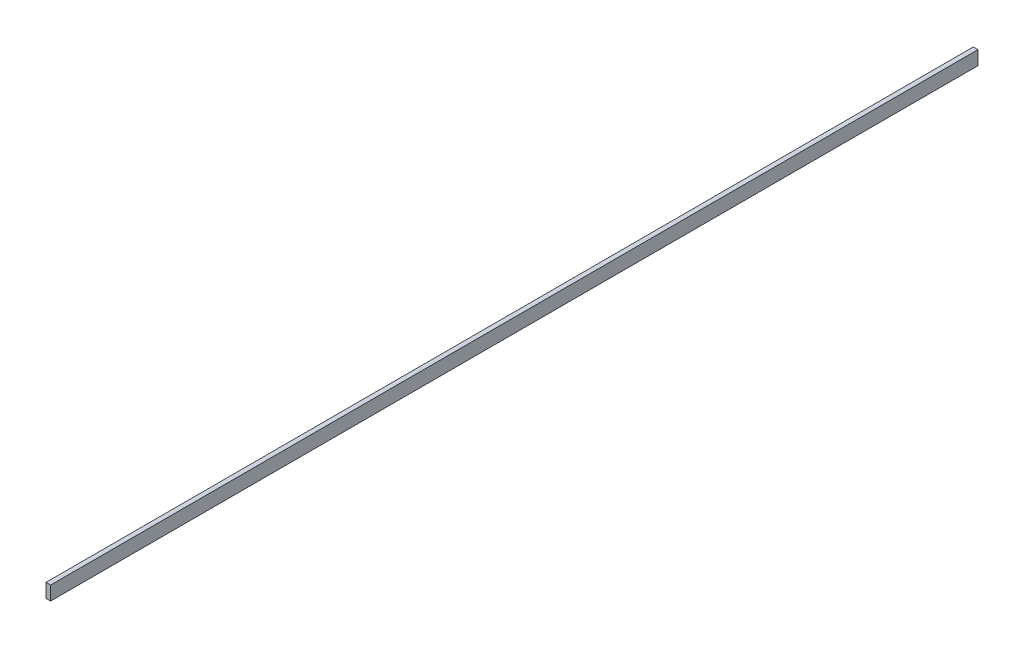
ISO-10303-21;
HEADER;
FILE_DESCRIPTION(('STEP AP214'),'2;1');
FILE_NAME('part.step','',(''),(''),'','','');
FILE_SCHEMA(('AUTOMOTIVE_DESIGN { 1 0 10303 214 1 1 1 1 }'));
ENDSEC;
DATA;
#1=APPLICATION_CONTEXT('core data for automotive mechanical design processes');
#2=APPLICATION_PROTOCOL_DEFINITION('international standard','automotive_design',2000,#1);
#3=PRODUCT_CONTEXT('',#1,'mechanical');
#4=PRODUCT('Part','Part','',(#3));
#5=PRODUCT_RELATED_PRODUCT_CATEGORY('part','',(#4));
#6=PRODUCT_DEFINITION_FORMATION('','',#4);
#7=PRODUCT_DEFINITION_CONTEXT('part definition',#1,'design');
#8=PRODUCT_DEFINITION('design','',#6,#7);
#9=PRODUCT_DEFINITION_SHAPE('','',#8);
#10=(LENGTH_UNIT() NAMED_UNIT(*) SI_UNIT(.MILLI.,.METRE.));
#11=(NAMED_UNIT(*) PLANE_ANGLE_UNIT() SI_UNIT($,.RADIAN.));
#12=(NAMED_UNIT(*) SI_UNIT($,.STERADIAN.) SOLID_ANGLE_UNIT());
#13=UNCERTAINTY_MEASURE_WITH_UNIT(LENGTH_MEASURE(1.E-05),#10,'distance_accuracy_value','');
#14=(GEOMETRIC_REPRESENTATION_CONTEXT(3) GLOBAL_UNCERTAINTY_ASSIGNED_CONTEXT((#13)) GLOBAL_UNIT_ASSIGNED_CONTEXT((#10,
#11,#12)) REPRESENTATION_CONTEXT('',''));
#15=CARTESIAN_POINT('',(0.,0.,0.));
#16=DIRECTION('',(0.,0.,1.));
#17=DIRECTION('',(1.,0.,0.));
#18=AXIS2_PLACEMENT_3D('',#15,#16,#17);
#19=CARTESIAN_POINT('',(0.,0.,0.));
#20=DIRECTION('',(0.,0.,1.));
#21=DIRECTION('',(1.,0.,0.));
#22=AXIS2_PLACEMENT_3D('',#19,#20,#21);
#23=PLANE('',#22);
#24=DIRECTION('',(0.,1.,0.));
#25=VECTOR('',#24,1.);
#26=CARTESIAN_POINT('',(1.,3.,0.));
#27=LINE('',#26,#25);
#28=CARTESIAN_POINT('',(1.,-3.,0.));
#29=VERTEX_POINT('',#28);
#30=CARTESIAN_POINT('',(1.,3.,0.));
#31=VERTEX_POINT('',#30);
#32=EDGE_CURVE('E72',#29,#31,#27,.T.);
#33=ORIENTED_EDGE('',*,*,#32,.T.);
#34=DIRECTION('',(-1.,0.,0.));
#35=VECTOR('',#34,1.);
#36=CARTESIAN_POINT('',(-1.,3.,0.));
#37=LINE('',#36,#35);
#38=CARTESIAN_POINT('',(-1.,3.,0.));
#39=VERTEX_POINT('',#38);
#40=EDGE_CURVE('E67',#31,#39,#37,.T.);
#41=ORIENTED_EDGE('',*,*,#40,.T.);
#42=DIRECTION('',(0.,-1.,0.));
#43=VECTOR('',#42,1.);
#44=CARTESIAN_POINT('',(-1.,3.,0.));
#45=LINE('',#44,#43);
#46=CARTESIAN_POINT('',(-1.,-3.,0.));
#47=VERTEX_POINT('',#46);
#48=EDGE_CURVE('E84',#39,#47,#45,.T.);
#49=ORIENTED_EDGE('',*,*,#48,.T.);
#50=DIRECTION('',(1.,0.,0.));
#51=VECTOR('',#50,1.);
#52=CARTESIAN_POINT('',(-1.,-3.,0.));
#53=LINE('',#52,#51);
#54=EDGE_CURVE('E77',#47,#29,#53,.T.);
#55=ORIENTED_EDGE('',*,*,#54,.T.);
#56=EDGE_LOOP('',(#33,#41,#49,#55));
#57=FACE_BOUND('',#56,.T.);
#58=ADVANCED_FACE('F32',(#57),#23,.T.);
#59=CARTESIAN_POINT('',(0.,0.,-400.));
#60=DIRECTION('',(0.,0.,1.));
#61=DIRECTION('',(1.,0.,0.));
#62=AXIS2_PLACEMENT_3D('',#59,#60,#61);
#63=PLANE('',#62);
#64=DIRECTION('',(0.,1.,0.));
#65=VECTOR('',#64,1.);
#66=CARTESIAN_POINT('',(1.,3.,-400.));
#67=LINE('',#66,#65);
#68=CARTESIAN_POINT('',(1.,-3.,-400.));
#69=VERTEX_POINT('',#68);
#70=CARTESIAN_POINT('',(1.,3.,-400.));
#71=VERTEX_POINT('',#70);
#72=EDGE_CURVE('E46',#69,#71,#67,.T.);
#73=ORIENTED_EDGE('',*,*,#72,.F.);
#74=DIRECTION('',(1.,0.,0.));
#75=VECTOR('',#74,1.);
#76=CARTESIAN_POINT('',(-1.,-3.,-400.));
#77=LINE('',#76,#75);
#78=CARTESIAN_POINT('',(-1.,-3.,-400.));
#79=VERTEX_POINT('',#78);
#80=EDGE_CURVE('E55',#79,#69,#77,.T.);
#81=ORIENTED_EDGE('',*,*,#80,.F.);
#82=DIRECTION('',(0.,-1.,0.));
#83=VECTOR('',#82,1.);
#84=CARTESIAN_POINT('',(-1.,3.,-400.));
#85=LINE('',#84,#83);
#86=CARTESIAN_POINT('',(-1.,3.,-400.));
#87=VERTEX_POINT('',#86);
#88=EDGE_CURVE('E92',#87,#79,#85,.T.);
#89=ORIENTED_EDGE('',*,*,#88,.F.);
#90=DIRECTION('',(-1.,0.,0.));
#91=VECTOR('',#90,1.);
#92=CARTESIAN_POINT('',(-1.,3.,-400.));
#93=LINE('',#92,#91);
#94=EDGE_CURVE('E11',#71,#87,#93,.T.);
#95=ORIENTED_EDGE('',*,*,#94,.F.);
#96=EDGE_LOOP('',(#73,#81,#89,#95));
#97=FACE_BOUND('',#96,.T.);
#98=ADVANCED_FACE('F114',(#97),#63,.F.);
#99=CARTESIAN_POINT('',(-1.,3.,0.));
#100=DIRECTION('',(1.,0.,0.));
#101=DIRECTION('',(0.,1.,0.));
#102=AXIS2_PLACEMENT_3D('',#99,#100,#101);
#103=PLANE('',#102);
#104=DIRECTION('',(0.,0.,-1.));
#105=VECTOR('',#104,1.);
#106=CARTESIAN_POINT('',(-1.,-3.,0.));
#107=LINE('',#106,#105);
#108=EDGE_CURVE('E87',#47,#79,#107,.T.);
#109=ORIENTED_EDGE('',*,*,#108,.F.);
#110=ORIENTED_EDGE('',*,*,#48,.F.);
#111=DIRECTION('',(0.,0.,-1.));
#112=VECTOR('',#111,1.);
#113=CARTESIAN_POINT('',(-1.,3.,0.));
#114=LINE('',#113,#112);
#115=EDGE_CURVE('E86',#39,#87,#114,.T.);
#116=ORIENTED_EDGE('',*,*,#115,.T.);
#117=ORIENTED_EDGE('',*,*,#88,.T.);
#118=EDGE_LOOP('',(#109,#110,#116,#117));
#119=FACE_BOUND('',#118,.T.);
#120=ADVANCED_FACE('F85',(#119),#103,.F.);
#121=CARTESIAN_POINT('',(-1.,-3.,0.));
#122=DIRECTION('',(0.,1.,0.));
#123=DIRECTION('',(0.,0.,1.));
#124=AXIS2_PLACEMENT_3D('',#121,#122,#123);
#125=PLANE('',#124);
#126=DIRECTION('',(0.,0.,-1.));
#127=VECTOR('',#126,1.);
#128=CARTESIAN_POINT('',(1.,-3.,0.));
#129=LINE('',#128,#127);
#130=EDGE_CURVE('E99',#29,#69,#129,.T.);
#131=ORIENTED_EDGE('',*,*,#130,.F.);
#132=ORIENTED_EDGE('',*,*,#54,.F.);
#133=ORIENTED_EDGE('',*,*,#108,.T.);
#134=ORIENTED_EDGE('',*,*,#80,.T.);
#135=EDGE_LOOP('',(#131,#132,#133,#134));
#136=FACE_BOUND('',#135,.T.);
#137=ADVANCED_FACE('F105',(#136),#125,.F.);
#138=CARTESIAN_POINT('',(1.,3.,0.));
#139=DIRECTION('',(-1.,0.,0.));
#140=DIRECTION('',(0.,-1.,0.));
#141=AXIS2_PLACEMENT_3D('',#138,#139,#140);
#142=PLANE('',#141);
#143=DIRECTION('',(0.,0.,-1.));
#144=VECTOR('',#143,1.);
#145=CARTESIAN_POINT('',(1.,3.,0.));
#146=LINE('',#145,#144);
#147=EDGE_CURVE('E39',#31,#71,#146,.T.);
#148=ORIENTED_EDGE('',*,*,#147,.F.);
#149=ORIENTED_EDGE('',*,*,#32,.F.);
#150=ORIENTED_EDGE('',*,*,#130,.T.);
#151=ORIENTED_EDGE('',*,*,#72,.T.);
#152=EDGE_LOOP('',(#148,#149,#150,#151));
#153=FACE_BOUND('',#152,.T.);
#154=ADVANCED_FACE('F103',(#153),#142,.F.);
#155=CARTESIAN_POINT('',(-1.,3.,0.));
#156=DIRECTION('',(0.,-1.,0.));
#157=DIRECTION('',(0.,0.,-1.));
#158=AXIS2_PLACEMENT_3D('',#155,#156,#157);
#159=PLANE('',#158);
#160=ORIENTED_EDGE('',*,*,#94,.T.);
#161=ORIENTED_EDGE('',*,*,#115,.F.);
#162=ORIENTED_EDGE('',*,*,#40,.F.);
#163=ORIENTED_EDGE('',*,*,#147,.T.);
#164=EDGE_LOOP('',(#160,#161,#162,#163));
#165=FACE_BOUND('',#164,.T.);
#166=ADVANCED_FACE('F90',(#165),#159,.F.);
#167=CLOSED_SHELL('',(#58,#98,#120,#137,#154,#166));
#168=MANIFOLD_SOLID_BREP('B2',#167);
#169=ADVANCED_BREP_SHAPE_REPRESENTATION('',(#18,#168),#14);
#170=SHAPE_DEFINITION_REPRESENTATION(#9,#169);
ENDSEC;
END-ISO-10303-21;
